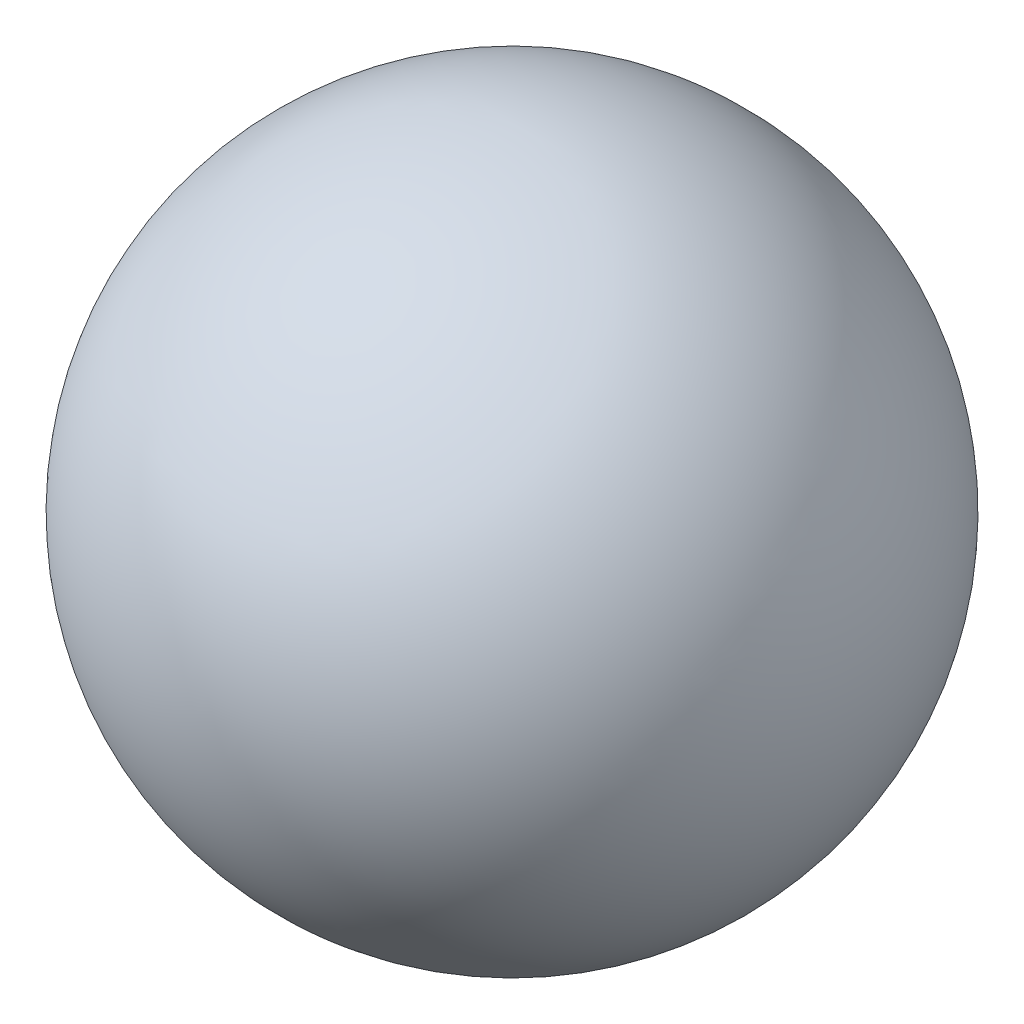
ISO-10303-21;
HEADER;
FILE_DESCRIPTION(('STEP AP214'),'2;1');
FILE_NAME('part.step','',(''),(''),'','','');
FILE_SCHEMA(('AUTOMOTIVE_DESIGN { 1 0 10303 214 1 1 1 1 }'));
ENDSEC;
DATA;
#1=APPLICATION_CONTEXT('core data for automotive mechanical design processes');
#2=APPLICATION_PROTOCOL_DEFINITION('international standard','automotive_design',2000,#1);
#3=PRODUCT_CONTEXT('',#1,'mechanical');
#4=PRODUCT('Part','Part','',(#3));
#5=PRODUCT_RELATED_PRODUCT_CATEGORY('part','',(#4));
#6=PRODUCT_DEFINITION_FORMATION('','',#4);
#7=PRODUCT_DEFINITION_CONTEXT('part definition',#1,'design');
#8=PRODUCT_DEFINITION('design','',#6,#7);
#9=PRODUCT_DEFINITION_SHAPE('','',#8);
#10=(LENGTH_UNIT() NAMED_UNIT(*) SI_UNIT(.MILLI.,.METRE.));
#11=(NAMED_UNIT(*) PLANE_ANGLE_UNIT() SI_UNIT($,.RADIAN.));
#12=(NAMED_UNIT(*) SI_UNIT($,.STERADIAN.) SOLID_ANGLE_UNIT());
#13=UNCERTAINTY_MEASURE_WITH_UNIT(LENGTH_MEASURE(1.E-05),#10,'distance_accuracy_value','');
#14=(GEOMETRIC_REPRESENTATION_CONTEXT(3) GLOBAL_UNCERTAINTY_ASSIGNED_CONTEXT((#13)) GLOBAL_UNIT_ASSIGNED_CONTEXT((#10,
#11,#12)) REPRESENTATION_CONTEXT('',''));
#15=CARTESIAN_POINT('',(0.,0.,0.));
#16=DIRECTION('',(0.,0.,1.));
#17=DIRECTION('',(1.,0.,0.));
#18=AXIS2_PLACEMENT_3D('',#15,#16,#17);
#19=CARTESIAN_POINT('',(67.76,-57.0016482498599,39.4954155953478));
#20=DIRECTION('',(0.,-0.821971206602399,0.569529047122792));
#21=DIRECTION('',(0.173648177666934,-0.560876621172181,-0.809483617014842));
#22=AXIS2_PLACEMENT_3D('',#19,#20,#21);
#23=SPHERICAL_SURFACE('',#22,7.15);
#24=CARTESIAN_POINT('',(67.76,-51.1245541226527,35.4232829084198));
#25=VERTEX_POINT('',#24);
#26=VERTEX_LOOP('',#25);
#27=FACE_BOUND('',#26,.T.);
#28=CARTESIAN_POINT('',(67.76,-62.878742377067,43.5675482822758));
#29=VERTEX_POINT('',#28);
#30=VERTEX_LOOP('',#29);
#31=FACE_BOUND('',#30,.T.);
#32=ADVANCED_FACE('F16',(#27,#31),#23,.T.);
#33=CLOSED_SHELL('',(#32));
#34=MANIFOLD_SOLID_BREP('B1',#33);
#35=ADVANCED_BREP_SHAPE_REPRESENTATION('',(#18,#34),#14);
#36=SHAPE_DEFINITION_REPRESENTATION(#9,#35);
ENDSEC;
END-ISO-10303-21;
